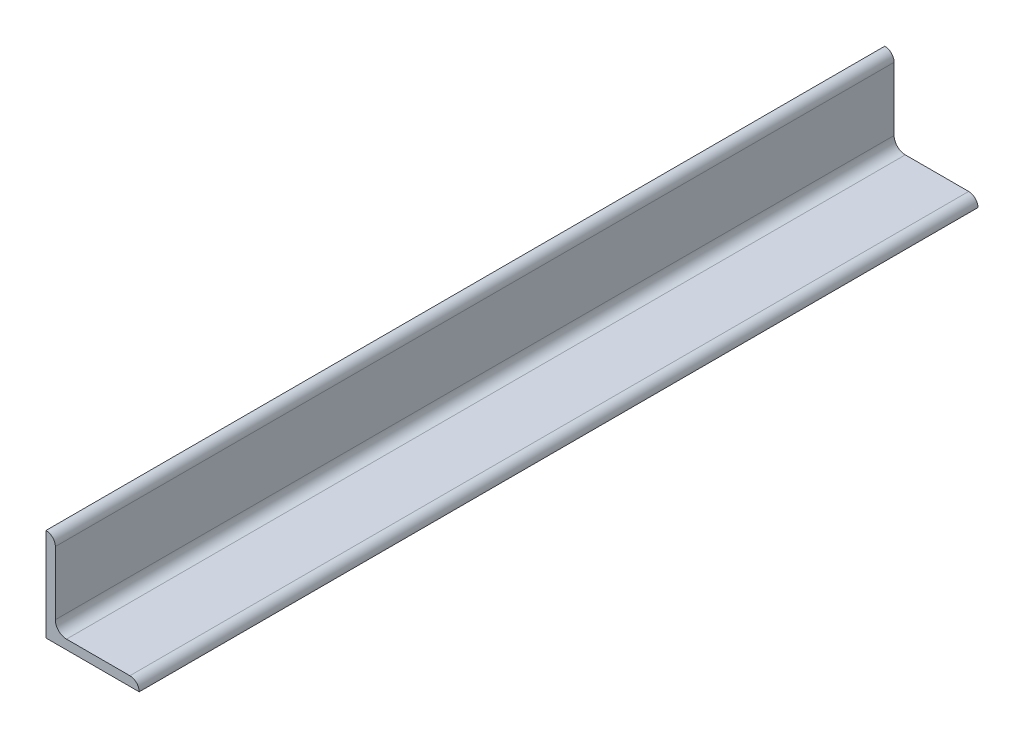
ISO-10303-21;
HEADER;
FILE_DESCRIPTION(('STEP AP214'),'2;1');
FILE_NAME('part.step','',(''),(''),'','','');
FILE_SCHEMA(('AUTOMOTIVE_DESIGN { 1 0 10303 214 1 1 1 1 }'));
ENDSEC;
DATA;
#1=APPLICATION_CONTEXT('core data for automotive mechanical design processes');
#2=APPLICATION_PROTOCOL_DEFINITION('international standard','automotive_design',2000,#1);
#3=PRODUCT_CONTEXT('',#1,'mechanical');
#4=PRODUCT('Part','Part','',(#3));
#5=PRODUCT_RELATED_PRODUCT_CATEGORY('part','',(#4));
#6=PRODUCT_DEFINITION_FORMATION('','',#4);
#7=PRODUCT_DEFINITION_CONTEXT('part definition',#1,'design');
#8=PRODUCT_DEFINITION('design','',#6,#7);
#9=PRODUCT_DEFINITION_SHAPE('','',#8);
#10=(LENGTH_UNIT() NAMED_UNIT(*) SI_UNIT(.MILLI.,.METRE.));
#11=(NAMED_UNIT(*) PLANE_ANGLE_UNIT() SI_UNIT($,.RADIAN.));
#12=(NAMED_UNIT(*) SI_UNIT($,.STERADIAN.) SOLID_ANGLE_UNIT());
#13=UNCERTAINTY_MEASURE_WITH_UNIT(LENGTH_MEASURE(1.E-05),#10,'distance_accuracy_value','');
#14=(GEOMETRIC_REPRESENTATION_CONTEXT(3) GLOBAL_UNCERTAINTY_ASSIGNED_CONTEXT((#13)) GLOBAL_UNIT_ASSIGNED_CONTEXT((#10,
#11,#12)) REPRESENTATION_CONTEXT('',''));
#15=CARTESIAN_POINT('',(0.,0.,0.));
#16=DIRECTION('',(0.,0.,1.));
#17=DIRECTION('',(1.,0.,0.));
#18=AXIS2_PLACEMENT_3D('',#15,#16,#17);
#19=CARTESIAN_POINT('',(100.,0.,450.));
#20=DIRECTION('',(0.,1.,0.));
#21=DIRECTION('',(-1.,0.,0.));
#22=AXIS2_PLACEMENT_3D('',#19,#20,#21);
#23=PLANE('',#22);
#24=DIRECTION('',(1.,0.,0.));
#25=VECTOR('',#24,1.);
#26=CARTESIAN_POINT('',(100.,0.,-450.));
#27=LINE('',#26,#25);
#28=CARTESIAN_POINT('',(0.,0.,-450.));
#29=VERTEX_POINT('',#28);
#30=CARTESIAN_POINT('',(100.,0.,-450.));
#31=VERTEX_POINT('',#30);
#32=EDGE_CURVE('E108',#29,#31,#27,.T.);
#33=ORIENTED_EDGE('',*,*,#32,.T.);
#34=DIRECTION('',(0.,0.,-1.));
#35=VECTOR('',#34,1.);
#36=CARTESIAN_POINT('',(100.,0.,450.));
#37=LINE('',#36,#35);
#38=CARTESIAN_POINT('',(100.,0.,450.));
#39=VERTEX_POINT('',#38);
#40=EDGE_CURVE('E106',#39,#31,#37,.T.);
#41=ORIENTED_EDGE('',*,*,#40,.F.);
#42=DIRECTION('',(1.,0.,0.));
#43=VECTOR('',#42,1.);
#44=CARTESIAN_POINT('',(100.,0.,450.));
#45=LINE('',#44,#43);
#46=CARTESIAN_POINT('',(0.,0.,450.));
#47=VERTEX_POINT('',#46);
#48=EDGE_CURVE('E93',#47,#39,#45,.T.);
#49=ORIENTED_EDGE('',*,*,#48,.F.);
#50=DIRECTION('',(0.,0.,-1.));
#51=VECTOR('',#50,1.);
#52=CARTESIAN_POINT('',(0.,0.,450.));
#53=LINE('',#52,#51);
#54=EDGE_CURVE('E128',#47,#29,#53,.T.);
#55=ORIENTED_EDGE('',*,*,#54,.T.);
#56=EDGE_LOOP('',(#33,#41,#49,#55));
#57=FACE_BOUND('',#56,.T.);
#58=ADVANCED_FACE('F34',(#57),#23,.F.);
#59=CARTESIAN_POINT('',(22.,10.,450.));
#60=DIRECTION('',(0.,-1.,0.));
#61=DIRECTION('',(0.,0.,-1.));
#62=AXIS2_PLACEMENT_3D('',#59,#60,#61);
#63=PLANE('',#62);
#64=DIRECTION('',(-1.,0.,0.));
#65=VECTOR('',#64,1.);
#66=CARTESIAN_POINT('',(22.,10.,450.));
#67=LINE('',#66,#65);
#68=CARTESIAN_POINT('',(90.,10.,450.));
#69=VERTEX_POINT('',#68);
#70=CARTESIAN_POINT('',(22.,10.,450.));
#71=VERTEX_POINT('',#70);
#72=EDGE_CURVE('E101',#69,#71,#67,.T.);
#73=ORIENTED_EDGE('',*,*,#72,.F.);
#74=DIRECTION('',(0.,0.,-1.));
#75=VECTOR('',#74,1.);
#76=CARTESIAN_POINT('',(90.,10.,450.));
#77=LINE('',#76,#75);
#78=CARTESIAN_POINT('',(90.,10.,-450.));
#79=VERTEX_POINT('',#78);
#80=EDGE_CURVE('E11',#69,#79,#77,.T.);
#81=ORIENTED_EDGE('',*,*,#80,.T.);
#82=DIRECTION('',(-1.,0.,0.));
#83=VECTOR('',#82,1.);
#84=CARTESIAN_POINT('',(22.,10.,-450.));
#85=LINE('',#84,#83);
#86=CARTESIAN_POINT('',(22.,10.,-450.));
#87=VERTEX_POINT('',#86);
#88=EDGE_CURVE('E135',#79,#87,#85,.T.);
#89=ORIENTED_EDGE('',*,*,#88,.T.);
#90=DIRECTION('',(0.,0.,-1.));
#91=VECTOR('',#90,1.);
#92=CARTESIAN_POINT('',(22.,10.,450.));
#93=LINE('',#92,#91);
#94=EDGE_CURVE('E111',#71,#87,#93,.T.);
#95=ORIENTED_EDGE('',*,*,#94,.F.);
#96=EDGE_LOOP('',(#73,#81,#89,#95));
#97=FACE_BOUND('',#96,.T.);
#98=ADVANCED_FACE('F147',(#97),#63,.F.);
#99=CARTESIAN_POINT('',(22.,22.,450.));
#100=DIRECTION('',(0.,0.,-1.));
#101=DIRECTION('',(-1.,0.,0.));
#102=AXIS2_PLACEMENT_3D('',#99,#100,#101);
#103=CYLINDRICAL_SURFACE('',#102,12.);
#104=CARTESIAN_POINT('',(22.,22.,-450.));
#105=DIRECTION('',(0.,0.,-1.));
#106=DIRECTION('',(-1.,0.,0.));
#107=AXIS2_PLACEMENT_3D('',#104,#105,#106);
#108=CIRCLE('',#107,12.);
#109=CARTESIAN_POINT('',(10.,22.,-450.));
#110=VERTEX_POINT('',#109);
#111=EDGE_CURVE('E133',#87,#110,#108,.T.);
#112=ORIENTED_EDGE('',*,*,#111,.T.);
#113=DIRECTION('',(0.,0.,-1.));
#114=VECTOR('',#113,1.);
#115=CARTESIAN_POINT('',(10.,22.,450.));
#116=LINE('',#115,#114);
#117=CARTESIAN_POINT('',(10.,22.,450.));
#118=VERTEX_POINT('',#117);
#119=EDGE_CURVE('E122',#118,#110,#116,.T.);
#120=ORIENTED_EDGE('',*,*,#119,.F.);
#121=CARTESIAN_POINT('',(22.,22.,450.));
#122=DIRECTION('',(0.,0.,-1.));
#123=DIRECTION('',(-1.,0.,0.));
#124=AXIS2_PLACEMENT_3D('',#121,#122,#123);
#125=CIRCLE('',#124,12.);
#126=EDGE_CURVE('E141',#71,#118,#125,.T.);
#127=ORIENTED_EDGE('',*,*,#126,.F.);
#128=ORIENTED_EDGE('',*,*,#94,.T.);
#129=EDGE_LOOP('',(#112,#120,#127,#128));
#130=FACE_BOUND('',#129,.T.);
#131=ADVANCED_FACE('F151',(#130),#103,.F.);
#132=CARTESIAN_POINT('',(9.99999999999999,100.,450.));
#133=DIRECTION('',(-1.,0.,0.));
#134=DIRECTION('',(0.,-1.,0.));
#135=AXIS2_PLACEMENT_3D('',#132,#133,#134);
#136=PLANE('',#135);
#137=DIRECTION('',(0.,1.,0.));
#138=VECTOR('',#137,1.);
#139=CARTESIAN_POINT('',(9.99999999999999,100.,-450.));
#140=LINE('',#139,#138);
#141=CARTESIAN_POINT('',(9.99999999999999,90.,-450.));
#142=VERTEX_POINT('',#141);
#143=EDGE_CURVE('E131',#110,#142,#140,.T.);
#144=ORIENTED_EDGE('',*,*,#143,.T.);
#145=DIRECTION('',(0.,0.,-1.));
#146=VECTOR('',#145,1.);
#147=CARTESIAN_POINT('',(9.99999999999999,90.,450.));
#148=LINE('',#147,#146);
#149=CARTESIAN_POINT('',(9.99999999999999,90.,450.));
#150=VERTEX_POINT('',#149);
#151=EDGE_CURVE('E57',#142,#150,#148,.F.);
#152=ORIENTED_EDGE('',*,*,#151,.T.);
#153=DIRECTION('',(0.,1.,0.));
#154=VECTOR('',#153,1.);
#155=CARTESIAN_POINT('',(9.99999999999999,100.,450.));
#156=LINE('',#155,#154);
#157=EDGE_CURVE('E139',#118,#150,#156,.T.);
#158=ORIENTED_EDGE('',*,*,#157,.F.);
#159=ORIENTED_EDGE('',*,*,#119,.T.);
#160=EDGE_LOOP('',(#144,#152,#158,#159));
#161=FACE_BOUND('',#160,.T.);
#162=ADVANCED_FACE('F153',(#161),#136,.F.);
#163=CARTESIAN_POINT('',(0.,100.,450.));
#164=DIRECTION('',(1.,0.,0.));
#165=DIRECTION('',(0.,1.,0.));
#166=AXIS2_PLACEMENT_3D('',#163,#164,#165);
#167=PLANE('',#166);
#168=DIRECTION('',(0.,-1.,0.));
#169=VECTOR('',#168,1.);
#170=CARTESIAN_POINT('',(0.,100.,-450.));
#171=LINE('',#170,#169);
#172=CARTESIAN_POINT('',(0.,100.,-450.));
#173=VERTEX_POINT('',#172);
#174=EDGE_CURVE('E102',#173,#29,#171,.T.);
#175=ORIENTED_EDGE('',*,*,#174,.T.);
#176=ORIENTED_EDGE('',*,*,#54,.F.);
#177=DIRECTION('',(0.,-1.,0.));
#178=VECTOR('',#177,1.);
#179=CARTESIAN_POINT('',(0.,100.,450.));
#180=LINE('',#179,#178);
#181=CARTESIAN_POINT('',(0.,100.,450.));
#182=VERTEX_POINT('',#181);
#183=EDGE_CURVE('E97',#182,#47,#180,.T.);
#184=ORIENTED_EDGE('',*,*,#183,.F.);
#185=DIRECTION('',(0.,0.,-1.));
#186=VECTOR('',#185,1.);
#187=CARTESIAN_POINT('',(0.,100.,450.));
#188=LINE('',#187,#186);
#189=EDGE_CURVE('E125',#182,#173,#188,.T.);
#190=ORIENTED_EDGE('',*,*,#189,.T.);
#191=EDGE_LOOP('',(#175,#176,#184,#190));
#192=FACE_BOUND('',#191,.T.);
#193=ADVANCED_FACE('F160',(#192),#167,.F.);
#194=CARTESIAN_POINT('',(22.,22.,450.));
#195=DIRECTION('',(0.,0.,-1.));
#196=DIRECTION('',(-1.,0.,0.));
#197=AXIS2_PLACEMENT_3D('',#194,#195,#196);
#198=PLANE('',#197);
#199=ORIENTED_EDGE('',*,*,#157,.T.);
#200=CARTESIAN_POINT('',(0.,90.,450.));
#201=DIRECTION('',(0.,0.,-1.));
#202=DIRECTION('',(-1.,0.,0.));
#203=AXIS2_PLACEMENT_3D('',#200,#201,#202);
#204=CIRCLE('',#203,10.);
#205=EDGE_CURVE('E42',#150,#182,#204,.F.);
#206=ORIENTED_EDGE('',*,*,#205,.T.);
#207=ORIENTED_EDGE('',*,*,#183,.T.);
#208=ORIENTED_EDGE('',*,*,#48,.T.);
#209=CARTESIAN_POINT('',(90.,0.,450.));
#210=DIRECTION('',(0.,0.,-1.));
#211=DIRECTION('',(-1.,0.,0.));
#212=AXIS2_PLACEMENT_3D('',#209,#210,#211);
#213=CIRCLE('',#212,10.);
#214=EDGE_CURVE('E49',#39,#69,#213,.F.);
#215=ORIENTED_EDGE('',*,*,#214,.T.);
#216=ORIENTED_EDGE('',*,*,#72,.T.);
#217=ORIENTED_EDGE('',*,*,#126,.T.);
#218=EDGE_LOOP('',(#199,#206,#207,#208,#215,#216,#217));
#219=FACE_BOUND('',#218,.T.);
#220=ADVANCED_FACE('F95',(#219),#198,.F.);
#221=CARTESIAN_POINT('',(22.,22.,-450.));
#222=DIRECTION('',(0.,0.,-1.));
#223=DIRECTION('',(-1.,0.,0.));
#224=AXIS2_PLACEMENT_3D('',#221,#222,#223);
#225=PLANE('',#224);
#226=ORIENTED_EDGE('',*,*,#174,.F.);
#227=CARTESIAN_POINT('',(0.,90.,-450.));
#228=DIRECTION('',(0.,0.,-1.));
#229=DIRECTION('',(-1.,0.,0.));
#230=AXIS2_PLACEMENT_3D('',#227,#228,#229);
#231=CIRCLE('',#230,10.);
#232=EDGE_CURVE('E115',#173,#142,#231,.T.);
#233=ORIENTED_EDGE('',*,*,#232,.T.);
#234=ORIENTED_EDGE('',*,*,#143,.F.);
#235=ORIENTED_EDGE('',*,*,#111,.F.);
#236=ORIENTED_EDGE('',*,*,#88,.F.);
#237=CARTESIAN_POINT('',(90.,0.,-450.));
#238=DIRECTION('',(0.,0.,-1.));
#239=DIRECTION('',(-1.,0.,0.));
#240=AXIS2_PLACEMENT_3D('',#237,#238,#239);
#241=CIRCLE('',#240,10.);
#242=EDGE_CURVE('E110',#79,#31,#241,.T.);
#243=ORIENTED_EDGE('',*,*,#242,.T.);
#244=ORIENTED_EDGE('',*,*,#32,.F.);
#245=EDGE_LOOP('',(#226,#233,#234,#235,#236,#243,#244));
#246=FACE_BOUND('',#245,.T.);
#247=ADVANCED_FACE('F162',(#246),#225,.T.);
#248=CARTESIAN_POINT('',(0.,90.,450.));
#249=DIRECTION('',(0.,0.,-1.));
#250=DIRECTION('',(-1.,0.,0.));
#251=AXIS2_PLACEMENT_3D('',#248,#249,#250);
#252=CYLINDRICAL_SURFACE('',#251,10.);
#253=ORIENTED_EDGE('',*,*,#205,.F.);
#254=ORIENTED_EDGE('',*,*,#151,.F.);
#255=ORIENTED_EDGE('',*,*,#232,.F.);
#256=ORIENTED_EDGE('',*,*,#189,.F.);
#257=EDGE_LOOP('',(#253,#254,#255,#256));
#258=FACE_BOUND('',#257,.T.);
#259=ADVANCED_FACE('F157',(#258),#252,.T.);
#260=CARTESIAN_POINT('',(90.,0.,450.));
#261=DIRECTION('',(0.,0.,-1.));
#262=DIRECTION('',(-1.,0.,0.));
#263=AXIS2_PLACEMENT_3D('',#260,#261,#262);
#264=CYLINDRICAL_SURFACE('',#263,10.);
#265=ORIENTED_EDGE('',*,*,#214,.F.);
#266=ORIENTED_EDGE('',*,*,#40,.T.);
#267=ORIENTED_EDGE('',*,*,#242,.F.);
#268=ORIENTED_EDGE('',*,*,#80,.F.);
#269=EDGE_LOOP('',(#265,#266,#267,#268));
#270=FACE_BOUND('',#269,.T.);
#271=ADVANCED_FACE('F36',(#270),#264,.T.);
#272=CLOSED_SHELL('',(#58,#98,#131,#162,#193,#220,#247,#259,#271));
#273=MANIFOLD_SOLID_BREP('B2',#272);
#274=ADVANCED_BREP_SHAPE_REPRESENTATION('',(#18,#273),#14);
#275=SHAPE_DEFINITION_REPRESENTATION(#9,#274);
ENDSEC;
END-ISO-10303-21;
